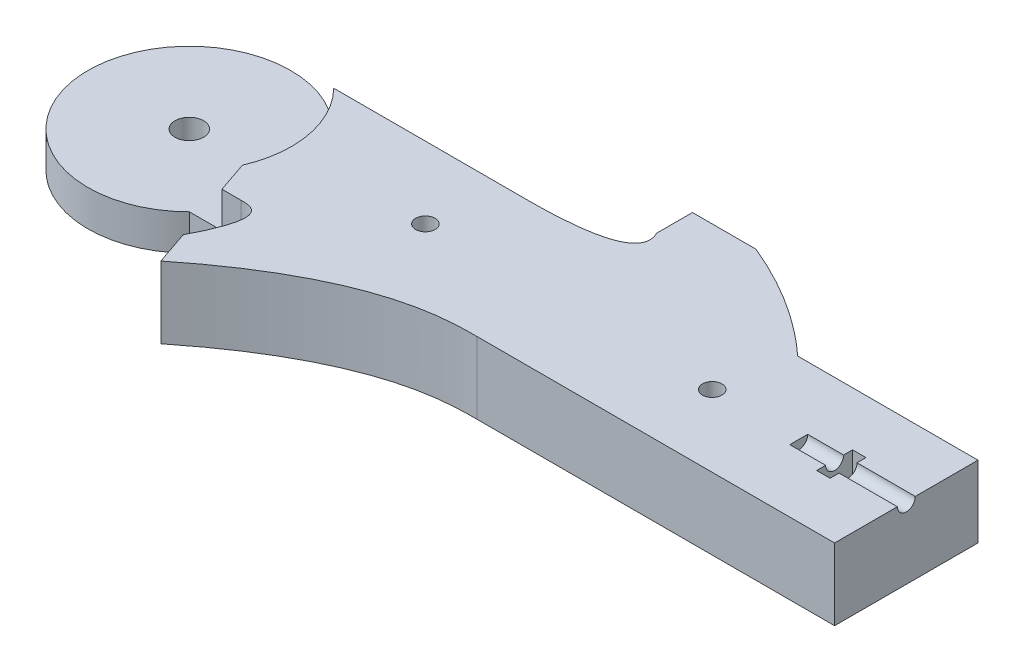
ISO-10303-21;
HEADER;
FILE_DESCRIPTION(('STEP AP214'),'2;1');
FILE_NAME('part.step','',(''),(''),'','','');
FILE_SCHEMA(('AUTOMOTIVE_DESIGN { 1 0 10303 214 1 1 1 1 }'));
ENDSEC;
DATA;
#1=APPLICATION_CONTEXT('core data for automotive mechanical design processes');
#2=APPLICATION_PROTOCOL_DEFINITION('international standard','automotive_design',2000,#1);
#3=PRODUCT_CONTEXT('',#1,'mechanical');
#4=PRODUCT('Part','Part','',(#3));
#5=PRODUCT_RELATED_PRODUCT_CATEGORY('part','',(#4));
#6=PRODUCT_DEFINITION_FORMATION('','',#4);
#7=PRODUCT_DEFINITION_CONTEXT('part definition',#1,'design');
#8=PRODUCT_DEFINITION('design','',#6,#7);
#9=PRODUCT_DEFINITION_SHAPE('','',#8);
#10=(LENGTH_UNIT() NAMED_UNIT(*) SI_UNIT(.MILLI.,.METRE.));
#11=(NAMED_UNIT(*) PLANE_ANGLE_UNIT() SI_UNIT($,.RADIAN.));
#12=(NAMED_UNIT(*) SI_UNIT($,.STERADIAN.) SOLID_ANGLE_UNIT());
#13=UNCERTAINTY_MEASURE_WITH_UNIT(LENGTH_MEASURE(1.E-05),#10,'distance_accuracy_value','');
#14=(GEOMETRIC_REPRESENTATION_CONTEXT(3) GLOBAL_UNCERTAINTY_ASSIGNED_CONTEXT((#13)) GLOBAL_UNIT_ASSIGNED_CONTEXT((#10,
#11,#12)) REPRESENTATION_CONTEXT('',''));
#15=CARTESIAN_POINT('',(0.,0.,0.));
#16=DIRECTION('',(0.,0.,1.));
#17=DIRECTION('',(1.,0.,0.));
#18=AXIS2_PLACEMENT_3D('',#15,#16,#17);
#19=CARTESIAN_POINT('',(-56.5620370370371,12.7,-6.10151852993586));
#20=DIRECTION('',(0.,0.,1.));
#21=DIRECTION('',(1.,0.,0.));
#22=AXIS2_PLACEMENT_3D('',#19,#20,#21);
#23=PLANE('',#22);
#24=DIRECTION('',(0.,1.,0.));
#25=VECTOR('',#24,1.);
#26=CARTESIAN_POINT('',(-22.0521428441884,-49.5130237421217,-6.10151852993586));
#27=LINE('',#26,#25);
#28=CARTESIAN_POINT('',(-22.0521428441884,0.,-6.10151852993586));
#29=VERTEX_POINT('',#28);
#30=CARTESIAN_POINT('',(-22.0521428441884,12.7,-6.10151852993586));
#31=VERTEX_POINT('',#30);
#32=EDGE_CURVE('E50',#29,#31,#27,.T.);
#33=ORIENTED_EDGE('',*,*,#32,.F.);
#34=DIRECTION('',(-1.,0.,0.));
#35=VECTOR('',#34,1.);
#36=CARTESIAN_POINT('',(-56.5620370370371,0.,-6.10151852993586));
#37=LINE('',#36,#35);
#38=CARTESIAN_POINT('',(-56.5620370370371,0.,-6.10151852993586));
#39=VERTEX_POINT('',#38);
#40=EDGE_CURVE('E414',#29,#39,#37,.T.);
#41=ORIENTED_EDGE('',*,*,#40,.T.);
#42=DIRECTION('',(0.,-1.,0.));
#43=VECTOR('',#42,1.);
#44=CARTESIAN_POINT('',(-56.5620370370371,12.7,-6.10151852993586));
#45=LINE('',#44,#43);
#46=CARTESIAN_POINT('',(-56.5620370370371,6.35,-6.10151852993585));
#47=VERTEX_POINT('',#46);
#48=EDGE_CURVE('E428',#47,#39,#45,.T.);
#49=ORIENTED_EDGE('',*,*,#48,.F.);
#50=DIRECTION('',(-1.,0.,0.));
#51=VECTOR('',#50,1.);
#52=CARTESIAN_POINT('',(-56.5620370370371,6.35,-6.10151852993586));
#53=LINE('',#52,#51);
#54=CARTESIAN_POINT('',(-56.3690348168402,6.35,-6.10151852993586));
#55=VERTEX_POINT('',#54);
#56=EDGE_CURVE('E392',#55,#47,#53,.T.);
#57=ORIENTED_EDGE('',*,*,#56,.F.);
#58=DIRECTION('',(0.,1.,0.));
#59=VECTOR('',#58,1.);
#60=CARTESIAN_POINT('',(-56.3690348168402,6.35,-6.10151852993586));
#61=LINE('',#60,#59);
#62=CARTESIAN_POINT('',(-56.3690348168402,12.7,-6.10151852993586));
#63=VERTEX_POINT('',#62);
#64=EDGE_CURVE('E394',#55,#63,#61,.T.);
#65=ORIENTED_EDGE('',*,*,#64,.T.);
#66=DIRECTION('',(-1.,0.,0.));
#67=VECTOR('',#66,1.);
#68=CARTESIAN_POINT('',(-56.5620370370371,12.7,-6.10151852993586));
#69=LINE('',#68,#67);
#70=EDGE_CURVE('E55',#31,#63,#69,.T.);
#71=ORIENTED_EDGE('',*,*,#70,.F.);
#72=EDGE_LOOP('',(#33,#41,#49,#57,#65,#71));
#73=FACE_BOUND('',#72,.T.);
#74=ADVANCED_FACE('F35',(#73),#23,.F.);
#75=DIRECTION('',(0.,1.,0.));
#76=VECTOR('',#75,1.);
#77=CARTESIAN_POINT('',(25.8044086413491,-49.5130237421217,-6.10151852993586));
#78=LINE('',#77,#76);
#79=CARTESIAN_POINT('',(25.8044086413491,0.,-6.10151852993586));
#80=VERTEX_POINT('',#79);
#81=CARTESIAN_POINT('',(25.8044086413491,12.7,-6.10151852993586));
#82=VERTEX_POINT('',#81);
#83=EDGE_CURVE('E255',#80,#82,#78,.T.);
#84=ORIENTED_EDGE('',*,*,#83,.T.);
#85=CARTESIAN_POINT('',(57.7379629629629,12.7,-6.10151852993586));
#86=VERTEX_POINT('',#85);
#87=EDGE_CURVE('E404',#86,#82,#69,.T.);
#88=ORIENTED_EDGE('',*,*,#87,.F.);
#89=DIRECTION('',(0.,-1.,0.));
#90=VECTOR('',#89,1.);
#91=CARTESIAN_POINT('',(57.7379629629629,12.7,-6.10151852993586));
#92=LINE('',#91,#90);
#93=CARTESIAN_POINT('',(57.7379629629629,0.,-6.10151852993586));
#94=VERTEX_POINT('',#93);
#95=EDGE_CURVE('E431',#86,#94,#92,.T.);
#96=ORIENTED_EDGE('',*,*,#95,.T.);
#97=EDGE_CURVE('E415',#94,#80,#37,.T.);
#98=ORIENTED_EDGE('',*,*,#97,.T.);
#99=EDGE_LOOP('',(#84,#88,#96,#98));
#100=FACE_BOUND('',#99,.T.);
#101=ADVANCED_FACE('F460',(#100),#23,.F.);
#102=CARTESIAN_POINT('',(-56.5620370370371,12.7,19.2984814700641));
#103=DIRECTION('',(0.,0.,-1.));
#104=DIRECTION('',(-1.,0.,0.));
#105=AXIS2_PLACEMENT_3D('',#102,#103,#104);
#106=PLANE('',#105);
#107=DIRECTION('',(0.,1.,0.));
#108=VECTOR('',#107,1.);
#109=CARTESIAN_POINT('',(-5.57588640904783,-44.9106074814327,19.2984814700641));
#110=LINE('',#109,#108);
#111=CARTESIAN_POINT('',(-5.57588640904783,0.,19.2984814700641));
#112=VERTEX_POINT('',#111);
#113=CARTESIAN_POINT('',(-5.57588640904783,12.7,19.2984814700641));
#114=VERTEX_POINT('',#113);
#115=EDGE_CURVE('E824',#112,#114,#110,.T.);
#116=ORIENTED_EDGE('',*,*,#115,.F.);
#117=DIRECTION('',(1.,0.,0.));
#118=VECTOR('',#117,1.);
#119=CARTESIAN_POINT('',(-56.5620370370371,0.,19.2984814700641));
#120=LINE('',#119,#118);
#121=CARTESIAN_POINT('',(57.7379629629629,0.,19.2984814700641));
#122=VERTEX_POINT('',#121);
#123=EDGE_CURVE('E420',#112,#122,#120,.T.);
#124=ORIENTED_EDGE('',*,*,#123,.T.);
#125=DIRECTION('',(0.,-1.,0.));
#126=VECTOR('',#125,1.);
#127=CARTESIAN_POINT('',(57.7379629629629,12.7,19.2984814700641));
#128=LINE('',#127,#126);
#129=CARTESIAN_POINT('',(57.7379629629629,12.7,19.2984814700641));
#130=VERTEX_POINT('',#129);
#131=EDGE_CURVE('E411',#130,#122,#128,.T.);
#132=ORIENTED_EDGE('',*,*,#131,.F.);
#133=DIRECTION('',(1.,0.,0.));
#134=VECTOR('',#133,1.);
#135=CARTESIAN_POINT('',(-56.5620370370371,12.7,19.2984814700641));
#136=LINE('',#135,#134);
#137=EDGE_CURVE('E407',#114,#130,#136,.T.);
#138=ORIENTED_EDGE('',*,*,#137,.F.);
#139=EDGE_LOOP('',(#116,#124,#132,#138));
#140=FACE_BOUND('',#139,.T.);
#141=ADVANCED_FACE('F505',(#140),#106,.F.);
#142=CARTESIAN_POINT('',(38.6879629629629,12.7,6.59848147006414));
#143=DIRECTION('',(1.,0.,0.));
#144=DIRECTION('',(0.,0.,-1.));
#145=AXIS2_PLACEMENT_3D('',#142,#143,#144);
#146=CYLINDRICAL_SURFACE('',#145,1.5875);
#147=DIRECTION('',(1.,0.,0.));
#148=VECTOR('',#147,1.);
#149=CARTESIAN_POINT('',(38.6879629629629,12.7,8.18598147006414));
#150=LINE('',#149,#148);
#151=CARTESIAN_POINT('',(45.0379629629629,12.7,8.18598147006414));
#152=VERTEX_POINT('',#151);
#153=CARTESIAN_POINT('',(38.6879629629629,12.7,8.18598147006414));
#154=VERTEX_POINT('',#153);
#155=EDGE_CURVE('E351',#152,#154,#150,.F.);
#156=ORIENTED_EDGE('',*,*,#155,.F.);
#157=CARTESIAN_POINT('',(45.0379629629629,12.7,6.59848147006414));
#158=DIRECTION('',(-1.,0.,0.));
#159=DIRECTION('',(0.,0.,1.));
#160=AXIS2_PLACEMENT_3D('',#157,#158,#159);
#161=CIRCLE('',#160,1.5875);
#162=CARTESIAN_POINT('',(45.0379629629629,12.7,5.01098147006415));
#163=VERTEX_POINT('',#162);
#164=EDGE_CURVE('E11',#152,#163,#161,.F.);
#165=ORIENTED_EDGE('',*,*,#164,.T.);
#166=DIRECTION('',(1.,0.,0.));
#167=VECTOR('',#166,1.);
#168=CARTESIAN_POINT('',(38.6879629629629,12.7,5.01098147006414));
#169=LINE('',#168,#167);
#170=CARTESIAN_POINT('',(38.6879629629629,12.7,5.01098147006414));
#171=VERTEX_POINT('',#170);
#172=EDGE_CURVE('E356',#171,#163,#169,.T.);
#173=ORIENTED_EDGE('',*,*,#172,.F.);
#174=CARTESIAN_POINT('',(38.6879629629629,12.7,6.59848147006414));
#175=DIRECTION('',(1.,0.,0.));
#176=DIRECTION('',(0.,0.,-1.));
#177=AXIS2_PLACEMENT_3D('',#174,#175,#176);
#178=CIRCLE('',#177,1.5875);
#179=EDGE_CURVE('E348',#154,#171,#178,.T.);
#180=ORIENTED_EDGE('',*,*,#179,.F.);
#181=EDGE_LOOP('',(#156,#165,#173,#180));
#182=FACE_BOUND('',#181,.T.);
#183=ADVANCED_FACE('F514',(#182),#146,.F.);
#184=CARTESIAN_POINT('',(-69.262037037037,12.7,6.59848147006414));
#185=DIRECTION('',(0.,-1.,0.));
#186=DIRECTION('',(0.,0.,-1.));
#187=AXIS2_PLACEMENT_3D('',#184,#185,#186);
#188=CYLINDRICAL_SURFACE('',#187,17.9605122421383);
#189=CARTESIAN_POINT('',(-69.262037037037,6.35,6.59848147006414));
#190=DIRECTION('',(0.,1.,0.));
#191=DIRECTION('',(0.,0.,1.));
#192=AXIS2_PLACEMENT_3D('',#189,#190,#191);
#193=CIRCLE('',#192,17.9605122421383);
#194=CARTESIAN_POINT('',(-56.5620370370371,6.35,19.2984814700641));
#195=VERTEX_POINT('',#194);
#196=EDGE_CURVE('E390',#47,#195,#193,.T.);
#197=ORIENTED_EDGE('',*,*,#196,.F.);
#198=ORIENTED_EDGE('',*,*,#48,.T.);
#199=CARTESIAN_POINT('',(-69.262037037037,0.,6.59848147006414));
#200=DIRECTION('',(0.,1.,0.));
#201=DIRECTION('',(0.,0.,-1.));
#202=AXIS2_PLACEMENT_3D('',#199,#200,#201);
#203=CIRCLE('',#202,17.9605122421383);
#204=CARTESIAN_POINT('',(-56.5620370370371,0.,19.2984814700641));
#205=VERTEX_POINT('',#204);
#206=EDGE_CURVE('E417',#39,#205,#203,.T.);
#207=ORIENTED_EDGE('',*,*,#206,.T.);
#208=DIRECTION('',(0.,-1.,0.));
#209=VECTOR('',#208,1.);
#210=CARTESIAN_POINT('',(-56.5620370370371,12.7,19.2984814700641));
#211=LINE('',#210,#209);
#212=EDGE_CURVE('E426',#195,#205,#211,.T.);
#213=ORIENTED_EDGE('',*,*,#212,.F.);
#214=EDGE_LOOP('',(#197,#198,#207,#213));
#215=FACE_BOUND('',#214,.T.);
#216=ADVANCED_FACE('F475',(#215),#188,.T.);
#217=CARTESIAN_POINT('',(-69.262037037037,12.7,6.59848147006414));
#218=DIRECTION('',(0.,-1.,0.));
#219=DIRECTION('',(0.,0.,-1.));
#220=AXIS2_PLACEMENT_3D('',#217,#218,#219);
#221=CYLINDRICAL_SURFACE('',#220,2.54);
#222=CARTESIAN_POINT('',(-69.262037037037,0.,6.59848147006414));
#223=DIRECTION('',(0.,1.,0.));
#224=DIRECTION('',(0.,0.,1.));
#225=AXIS2_PLACEMENT_3D('',#222,#223,#224);
#226=CIRCLE('',#225,2.54);
#227=CARTESIAN_POINT('',(-69.262037037037,0.,9.13848147006414));
#228=VERTEX_POINT('',#227);
#229=EDGE_CURVE('E396',#228,#228,#226,.T.);
#230=ORIENTED_EDGE('',*,*,#229,.F.);
#231=EDGE_LOOP('',(#230));
#232=FACE_BOUND('',#231,.T.);
#233=CARTESIAN_POINT('',(-69.262037037037,6.35,6.59848147006414));
#234=DIRECTION('',(0.,1.,0.));
#235=DIRECTION('',(0.,0.,1.));
#236=AXIS2_PLACEMENT_3D('',#233,#234,#235);
#237=CIRCLE('',#236,2.54);
#238=CARTESIAN_POINT('',(-69.262037037037,6.35,9.13848147006414));
#239=VERTEX_POINT('',#238);
#240=EDGE_CURVE('E385',#239,#239,#237,.T.);
#241=ORIENTED_EDGE('',*,*,#240,.T.);
#242=EDGE_LOOP('',(#241));
#243=FACE_BOUND('',#242,.T.);
#244=ADVANCED_FACE('F513',(#232,#243),#221,.F.);
#245=CARTESIAN_POINT('',(-69.262037037037,12.7,6.59848147006414));
#246=DIRECTION('',(0.,-1.,0.));
#247=DIRECTION('',(0.,0.,-1.));
#248=AXIS2_PLACEMENT_3D('',#245,#246,#247);
#249=PLANE('',#248);
#250=CARTESIAN_POINT('',(-27.4422931581062,12.7,6.59848147006414));
#251=DIRECTION('',(0.,-1.,0.));
#252=DIRECTION('',(0.,0.,-1.));
#253=AXIS2_PLACEMENT_3D('',#250,#251,#252);
#254=CIRCLE('',#253,1.72720000000001);
#255=CARTESIAN_POINT('',(-27.4422931581062,12.7,4.87128147006413));
#256=VERTEX_POINT('',#255);
#257=EDGE_CURVE('E367',#256,#256,#254,.T.);
#258=ORIENTED_EDGE('',*,*,#257,.T.);
#259=EDGE_LOOP('',(#258));
#260=FACE_BOUND('',#259,.T.);
#261=CARTESIAN_POINT('',(23.3577068418938,12.7,6.59848147006414));
#262=DIRECTION('',(0.,-1.,0.));
#263=DIRECTION('',(0.,0.,-1.));
#264=AXIS2_PLACEMENT_3D('',#261,#262,#263);
#265=CIRCLE('',#264,1.72720000000001);
#266=CARTESIAN_POINT('',(23.3577068418938,12.7,4.87128147006413));
#267=VERTEX_POINT('',#266);
#268=EDGE_CURVE('E379',#267,#267,#265,.T.);
#269=ORIENTED_EDGE('',*,*,#268,.T.);
#270=EDGE_LOOP('',(#269));
#271=FACE_BOUND('',#270,.T.);
#272=ORIENTED_EDGE('',*,*,#172,.T.);
#273=DIRECTION('',(0.,0.,1.));
#274=VECTOR('',#273,1.);
#275=CARTESIAN_POINT('',(45.0379629629629,12.7,9.77348147006416));
#276=LINE('',#275,#274);
#277=CARTESIAN_POINT('',(45.0379629629629,12.7,3.42348147006413));
#278=VERTEX_POINT('',#277);
#279=EDGE_CURVE('E326',#278,#163,#276,.T.);
#280=ORIENTED_EDGE('',*,*,#279,.F.);
#281=DIRECTION('',(-1.,0.,0.));
#282=VECTOR('',#281,1.);
#283=CARTESIAN_POINT('',(45.0379629629629,12.7,3.42348147006413));
#284=LINE('',#283,#282);
#285=CARTESIAN_POINT('',(47.4192129629629,12.7,3.42348147006413));
#286=VERTEX_POINT('',#285);
#287=EDGE_CURVE('E322',#286,#278,#284,.T.);
#288=ORIENTED_EDGE('',*,*,#287,.F.);
#289=DIRECTION('',(0.,0.,-1.));
#290=VECTOR('',#289,1.);
#291=CARTESIAN_POINT('',(47.4192129629629,12.7,3.42348147006413));
#292=LINE('',#291,#290);
#293=CARTESIAN_POINT('',(47.4192129629629,12.7,5.01098147006414));
#294=VERTEX_POINT('',#293);
#295=EDGE_CURVE('E318',#294,#286,#292,.T.);
#296=ORIENTED_EDGE('',*,*,#295,.F.);
#297=CARTESIAN_POINT('',(57.7379629629629,12.7,5.01098147006414));
#298=VERTEX_POINT('',#297);
#299=EDGE_CURVE('E355',#294,#298,#169,.T.);
#300=ORIENTED_EDGE('',*,*,#299,.T.);
#301=DIRECTION('',(0.,0.,-1.));
#302=VECTOR('',#301,1.);
#303=CARTESIAN_POINT('',(57.7379629629629,12.7,-6.10151852993586));
#304=LINE('',#303,#302);
#305=EDGE_CURVE('E403',#298,#86,#304,.T.);
#306=ORIENTED_EDGE('',*,*,#305,.T.);
#307=ORIENTED_EDGE('',*,*,#87,.T.);
#308=CARTESIAN_POINT('',(5.68711721311388,12.7,-18.8015185299359));
#309=CARTESIAN_POINT('',(17.0941996057411,12.7,-14.1176448631186));
#310=CARTESIAN_POINT('',(25.8044086413491,12.7,-6.10151852993586));
#311=B_SPLINE_CURVE_WITH_KNOTS('',2,(#308,#309,#310),.UNSPECIFIED.,.F.,.F.,(3,3),(0.,
0.7699329234087),.UNSPECIFIED.);
#312=CARTESIAN_POINT('',(5.68711721311388,12.7,-18.8015185299359));
#313=VERTEX_POINT('',#312);
#314=EDGE_CURVE('E227',#313,#82,#311,.T.);
#315=ORIENTED_EDGE('',*,*,#314,.F.);
#316=DIRECTION('',(1.,0.,0.));
#317=VECTOR('',#316,1.);
#318=CARTESIAN_POINT('',(-5.54086763995443,12.7,-18.8015185299359));
#319=LINE('',#318,#317);
#320=CARTESIAN_POINT('',(-5.54086763995443,12.7,-18.8015185299359));
#321=VERTEX_POINT('',#320);
#322=EDGE_CURVE('E204',#321,#313,#319,.T.);
#323=ORIENTED_EDGE('',*,*,#322,.F.);
#324=DIRECTION('',(0.,0.,-1.));
#325=VECTOR('',#324,1.);
#326=CARTESIAN_POINT('',(-5.54086763995443,12.7,-12.4515185299359));
#327=LINE('',#326,#325);
#328=CARTESIAN_POINT('',(-5.54086763995443,12.7,-12.4515185299359));
#329=VERTEX_POINT('',#328);
#330=EDGE_CURVE('E199',#329,#321,#327,.T.);
#331=ORIENTED_EDGE('',*,*,#330,.F.);
#332=CARTESIAN_POINT('',(-5.54086763995443,12.7,-12.4515185299359));
#333=CARTESIAN_POINT('',(-2.45676013605589,12.7,-6.10151852993586));
#334=CARTESIAN_POINT('',(-22.0521428441884,12.7,-6.10151852993586));
#335=B_SPLINE_CURVE_WITH_KNOTS('',2,(#332,#333,#334),.UNSPECIFIED.,.F.,.F.,(3,3),(0.,1.),.UNSPECIFIED.);
#336=EDGE_CURVE('E211',#329,#31,#335,.T.);
#337=ORIENTED_EDGE('',*,*,#336,.T.);
#338=ORIENTED_EDGE('',*,*,#70,.T.);
#339=CARTESIAN_POINT('',(-69.262037037037,12.7,6.59848147006414));
#340=DIRECTION('',(0.,1.,0.));
#341=DIRECTION('',(0.,0.,1.));
#342=AXIS2_PLACEMENT_3D('',#339,#340,#341);
#343=CIRCLE('',#342,18.0975);
#344=CARTESIAN_POINT('',(-52.6576296854306,12.7,13.796617531012));
#345=VERTEX_POINT('',#344);
#346=EDGE_CURVE('E382',#345,#63,#343,.T.);
#347=ORIENTED_EDGE('',*,*,#346,.F.);
#348=DIRECTION('',(-0.322805874294675,0.,-0.946465196148728));
#349=VECTOR('',#348,1.);
#350=CARTESIAN_POINT('',(-50.7811380761005,12.7,19.2984814700641));
#351=LINE('',#350,#349);
#352=CARTESIAN_POINT('',(-50.7811380761005,12.7,19.2984814700641));
#353=VERTEX_POINT('',#352);
#354=EDGE_CURVE('E338',#353,#345,#351,.T.);
#355=ORIENTED_EDGE('',*,*,#354,.F.);
#356=CARTESIAN_POINT('',(-47.3781705248904,12.7,19.2984814700641));
#357=VERTEX_POINT('',#356);
#358=EDGE_CURVE('E408',#353,#357,#136,.T.);
#359=ORIENTED_EDGE('',*,*,#358,.T.);
#360=CARTESIAN_POINT('',(-47.2315525581981,12.7,29.7058483148863));
#361=CARTESIAN_POINT('',(-41.7251153372007,12.7,19.2984814700641));
#362=CARTESIAN_POINT('',(-45.408751787825,12.7,19.2984814700641));
#363=CARTESIAN_POINT('',(-47.3781705248904,12.7,19.2984814700641));
#364=B_SPLINE_CURVE_WITH_KNOTS('',3,(#360,#361,#362,#363),.UNSPECIFIED.,.F.,.F.,(4,4),(0.,1.),.UNSPECIFIED.);
#365=CARTESIAN_POINT('',(-47.2315525581981,12.7,29.7058483148863));
#366=VERTEX_POINT('',#365);
#367=EDGE_CURVE('E840',#366,#357,#364,.T.);
#368=ORIENTED_EDGE('',*,*,#367,.F.);
#369=DIRECTION('',(-0.322805874294675,0.,-0.946465196148728));
#370=VECTOR('',#369,1.);
#371=CARTESIAN_POINT('',(-45.1817352564269,12.7,35.7159023104307));
#372=LINE('',#371,#370);
#373=CARTESIAN_POINT('',(-45.1817352564269,12.7,35.7159023104307));
#374=VERTEX_POINT('',#373);
#375=EDGE_CURVE('E319',#374,#366,#372,.T.);
#376=ORIENTED_EDGE('',*,*,#375,.F.);
#377=CARTESIAN_POINT('',(-45.1817352564269,12.7,35.7159023104307));
#378=CARTESIAN_POINT('',(-24.6245664486509,12.7,19.2984814700641));
#379=CARTESIAN_POINT('',(-11.56568916727,12.7,19.2984814700641));
#380=CARTESIAN_POINT('',(-5.57588640904783,12.7,19.2984814700641));
#381=B_SPLINE_CURVE_WITH_KNOTS('',3,(#377,#378,#379,#380),.UNSPECIFIED.,.F.,.F.,(4,4),(0.,1.),.UNSPECIFIED.);
#382=EDGE_CURVE('E832',#374,#114,#381,.T.);
#383=ORIENTED_EDGE('',*,*,#382,.T.);
#384=ORIENTED_EDGE('',*,*,#137,.T.);
#385=CARTESIAN_POINT('',(57.7379629629629,12.7,8.18598147006414));
#386=VERTEX_POINT('',#385);
#387=EDGE_CURVE('E400',#130,#386,#304,.T.);
#388=ORIENTED_EDGE('',*,*,#387,.T.);
#389=CARTESIAN_POINT('',(47.4192129629629,12.7,8.18598147006414));
#390=VERTEX_POINT('',#389);
#391=EDGE_CURVE('E352',#386,#390,#150,.F.);
#392=ORIENTED_EDGE('',*,*,#391,.T.);
#393=CARTESIAN_POINT('',(47.4192129629629,12.7,9.77348147006416));
#394=VERTEX_POINT('',#393);
#395=EDGE_CURVE('E320',#394,#390,#292,.T.);
#396=ORIENTED_EDGE('',*,*,#395,.F.);
#397=DIRECTION('',(1.,0.,0.));
#398=VECTOR('',#397,1.);
#399=CARTESIAN_POINT('',(45.0379629629629,12.7,9.77348147006416));
#400=LINE('',#399,#398);
#401=CARTESIAN_POINT('',(45.0379629629629,12.7,9.77348147006416));
#402=VERTEX_POINT('',#401);
#403=EDGE_CURVE('E315',#402,#394,#400,.T.);
#404=ORIENTED_EDGE('',*,*,#403,.F.);
#405=EDGE_CURVE('E325',#152,#402,#276,.T.);
#406=ORIENTED_EDGE('',*,*,#405,.F.);
#407=ORIENTED_EDGE('',*,*,#155,.T.);
#408=DIRECTION('',(0.,0.,1.));
#409=VECTOR('',#408,1.);
#410=CARTESIAN_POINT('',(38.6879629629629,12.7,6.59848147006414));
#411=LINE('',#410,#409);
#412=EDGE_CURVE('E439',#171,#154,#411,.T.);
#413=ORIENTED_EDGE('',*,*,#412,.F.);
#414=EDGE_LOOP('',(#272,#280,#288,#296,#300,#306,#307,#315,#323,#331,#337,#338,#347,#355,#359,
#368,#376,#383,#384,#388,#392,#396,#404,#406,#407,#413));
#415=FACE_BOUND('',#414,.T.);
#416=ADVANCED_FACE('F210',(#260,#271,#415),#249,.F.);
#417=CARTESIAN_POINT('',(-69.262037037037,0.,6.59848147006414));
#418=DIRECTION('',(0.,-1.,0.));
#419=DIRECTION('',(0.,0.,-1.));
#420=AXIS2_PLACEMENT_3D('',#417,#418,#419);
#421=PLANE('',#420);
#422=CARTESIAN_POINT('',(-27.4422931581062,0.,6.59848147006414));
#423=DIRECTION('',(0.,-1.,0.));
#424=DIRECTION('',(0.,0.,-1.));
#425=AXIS2_PLACEMENT_3D('',#422,#423,#424);
#426=CIRCLE('',#425,3.77062999999999);
#427=CARTESIAN_POINT('',(-27.4422931581062,0.,2.82785147006415));
#428=VERTEX_POINT('',#427);
#429=EDGE_CURVE('E358',#428,#428,#426,.T.);
#430=ORIENTED_EDGE('',*,*,#429,.F.);
#431=EDGE_LOOP('',(#430));
#432=FACE_BOUND('',#431,.T.);
#433=CARTESIAN_POINT('',(23.3577068418938,0.,6.59848147006414));
#434=DIRECTION('',(0.,-1.,0.));
#435=DIRECTION('',(0.,0.,-1.));
#436=AXIS2_PLACEMENT_3D('',#433,#434,#435);
#437=CIRCLE('',#436,3.77062999999999);
#438=CARTESIAN_POINT('',(23.3577068418938,0.,2.82785147006415));
#439=VERTEX_POINT('',#438);
#440=EDGE_CURVE('E370',#439,#439,#437,.T.);
#441=ORIENTED_EDGE('',*,*,#440,.F.);
#442=EDGE_LOOP('',(#441));
#443=FACE_BOUND('',#442,.T.);
#444=DIRECTION('',(0.,0.,-1.));
#445=VECTOR('',#444,1.);
#446=CARTESIAN_POINT('',(57.7379629629629,0.,-6.10151852993586));
#447=LINE('',#446,#445);
#448=EDGE_CURVE('E399',#122,#94,#447,.T.);
#449=ORIENTED_EDGE('',*,*,#448,.F.);
#450=ORIENTED_EDGE('',*,*,#123,.F.);
#451=CARTESIAN_POINT('',(-45.1817352564269,0.,35.7159023104307));
#452=CARTESIAN_POINT('',(-24.6245664486509,0.,19.2984814700641));
#453=CARTESIAN_POINT('',(-11.56568916727,0.,19.2984814700641));
#454=CARTESIAN_POINT('',(-5.57588640904783,0.,19.2984814700641));
#455=B_SPLINE_CURVE_WITH_KNOTS('',3,(#451,#452,#453,#454),.UNSPECIFIED.,.F.,.F.,(4,4),(0.,1.),.UNSPECIFIED.);
#456=CARTESIAN_POINT('',(-45.1817352564269,0.,35.7159023104307));
#457=VERTEX_POINT('',#456);
#458=EDGE_CURVE('E828',#457,#112,#455,.T.);
#459=ORIENTED_EDGE('',*,*,#458,.F.);
#460=DIRECTION('',(-0.322805874294675,0.,-0.946465196148728));
#461=VECTOR('',#460,1.);
#462=CARTESIAN_POINT('',(-45.1817352564269,0.,35.7159023104307));
#463=LINE('',#462,#461);
#464=CARTESIAN_POINT('',(-47.2315525581981,0.,29.7058483148863));
#465=VERTEX_POINT('',#464);
#466=EDGE_CURVE('E214',#457,#465,#463,.T.);
#467=ORIENTED_EDGE('',*,*,#466,.T.);
#468=CARTESIAN_POINT('',(-47.2315525581981,0.,29.7058483148863));
#469=CARTESIAN_POINT('',(-41.7251153372007,0.,19.2984814700641));
#470=CARTESIAN_POINT('',(-45.408751787825,0.,19.2984814700641));
#471=CARTESIAN_POINT('',(-47.3781705248904,0.,19.2984814700641));
#472=B_SPLINE_CURVE_WITH_KNOTS('',3,(#468,#469,#470,#471),.UNSPECIFIED.,.F.,.F.,(4,4),(0.,1.),.UNSPECIFIED.);
#473=CARTESIAN_POINT('',(-47.3781705248904,0.,19.2984814700641));
#474=VERTEX_POINT('',#473);
#475=EDGE_CURVE('E838',#465,#474,#472,.T.);
#476=ORIENTED_EDGE('',*,*,#475,.T.);
#477=EDGE_CURVE('E421',#205,#474,#120,.T.);
#478=ORIENTED_EDGE('',*,*,#477,.F.);
#479=ORIENTED_EDGE('',*,*,#206,.F.);
#480=ORIENTED_EDGE('',*,*,#40,.F.);
#481=CARTESIAN_POINT('',(-5.54086763995443,0.,-12.4515185299359));
#482=CARTESIAN_POINT('',(-2.45676013605589,0.,-6.10151852993586));
#483=CARTESIAN_POINT('',(-22.0521428441884,0.,-6.10151852993586));
#484=B_SPLINE_CURVE_WITH_KNOTS('',2,(#481,#482,#483),.UNSPECIFIED.,.F.,.F.,(3,3),(0.,1.),.UNSPECIFIED.);
#485=CARTESIAN_POINT('',(-5.54086763995443,0.,-12.4515185299359));
#486=VERTEX_POINT('',#485);
#487=EDGE_CURVE('E217',#486,#29,#484,.T.);
#488=ORIENTED_EDGE('',*,*,#487,.F.);
#489=DIRECTION('',(0.,0.,-1.));
#490=VECTOR('',#489,1.);
#491=CARTESIAN_POINT('',(-5.54086763995443,0.,-12.4515185299359));
#492=LINE('',#491,#490);
#493=CARTESIAN_POINT('',(-5.54086763995443,0.,-18.8015185299359));
#494=VERTEX_POINT('',#493);
#495=EDGE_CURVE('E200',#486,#494,#492,.T.);
#496=ORIENTED_EDGE('',*,*,#495,.T.);
#497=DIRECTION('',(1.,0.,0.));
#498=VECTOR('',#497,1.);
#499=CARTESIAN_POINT('',(-5.54086763995443,0.,-18.8015185299359));
#500=LINE('',#499,#498);
#501=CARTESIAN_POINT('',(5.68711721311388,0.,-18.8015185299359));
#502=VERTEX_POINT('',#501);
#503=EDGE_CURVE('E222',#494,#502,#500,.T.);
#504=ORIENTED_EDGE('',*,*,#503,.T.);
#505=CARTESIAN_POINT('',(5.68711721311388,0.,-18.8015185299359));
#506=CARTESIAN_POINT('',(17.0941996057411,0.,-14.1176448631186));
#507=CARTESIAN_POINT('',(25.8044086413491,0.,-6.10151852993586));
#508=B_SPLINE_CURVE_WITH_KNOTS('',2,(#505,#506,#507),.UNSPECIFIED.,.F.,.F.,(3,3),(0.,
0.7699329234087),.UNSPECIFIED.);
#509=EDGE_CURVE('E218',#502,#80,#508,.T.);
#510=ORIENTED_EDGE('',*,*,#509,.T.);
#511=ORIENTED_EDGE('',*,*,#97,.F.);
#512=EDGE_LOOP('',(#449,#450,#459,#467,#476,#478,#479,#480,#488,#496,#504,#510,#511));
#513=FACE_BOUND('',#512,.T.);
#514=ORIENTED_EDGE('',*,*,#229,.T.);
#515=EDGE_LOOP('',(#514));
#516=FACE_BOUND('',#515,.T.);
#517=ADVANCED_FACE('F467',(#432,#443,#513,#516),#421,.T.);
#518=CARTESIAN_POINT('',(57.7379629629629,12.7,-6.10151852993586));
#519=DIRECTION('',(-1.,0.,0.));
#520=DIRECTION('',(0.,0.,1.));
#521=AXIS2_PLACEMENT_3D('',#518,#519,#520);
#522=PLANE('',#521);
#523=ORIENTED_EDGE('',*,*,#305,.F.);
#524=CARTESIAN_POINT('',(57.7379629629629,12.7,6.59848147006414));
#525=DIRECTION('',(-1.,0.,0.));
#526=DIRECTION('',(0.,0.,1.));
#527=AXIS2_PLACEMENT_3D('',#524,#525,#526);
#528=CIRCLE('',#527,1.5875);
#529=EDGE_CURVE('E434',#298,#386,#528,.T.);
#530=ORIENTED_EDGE('',*,*,#529,.T.);
#531=ORIENTED_EDGE('',*,*,#387,.F.);
#532=ORIENTED_EDGE('',*,*,#131,.T.);
#533=ORIENTED_EDGE('',*,*,#448,.T.);
#534=ORIENTED_EDGE('',*,*,#95,.F.);
#535=EDGE_LOOP('',(#523,#530,#531,#532,#533,#534));
#536=FACE_BOUND('',#535,.T.);
#537=ADVANCED_FACE('F37',(#536),#522,.F.);
#538=ORIENTED_EDGE('',*,*,#477,.T.);
#539=DIRECTION('',(0.,1.,0.));
#540=VECTOR('',#539,1.);
#541=CARTESIAN_POINT('',(-47.3781705248904,-44.9106074814327,19.2984814700641));
#542=LINE('',#541,#540);
#543=EDGE_CURVE('E827',#474,#357,#542,.T.);
#544=ORIENTED_EDGE('',*,*,#543,.T.);
#545=ORIENTED_EDGE('',*,*,#358,.F.);
#546=DIRECTION('',(0.,1.,0.));
#547=VECTOR('',#546,1.);
#548=CARTESIAN_POINT('',(-50.7811380761005,-2.73699166155966,19.2984814700641));
#549=LINE('',#548,#547);
#550=CARTESIAN_POINT('',(-50.7811380761005,6.35,19.2984814700641));
#551=VERTEX_POINT('',#550);
#552=EDGE_CURVE('E340',#551,#353,#549,.T.);
#553=ORIENTED_EDGE('',*,*,#552,.F.);
#554=DIRECTION('',(1.,0.,0.));
#555=VECTOR('',#554,1.);
#556=CARTESIAN_POINT('',(-56.5620370370371,6.35,19.2984814700641));
#557=LINE('',#556,#555);
#558=EDGE_CURVE('E388',#195,#551,#557,.T.);
#559=ORIENTED_EDGE('',*,*,#558,.F.);
#560=ORIENTED_EDGE('',*,*,#212,.T.);
#561=EDGE_LOOP('',(#538,#544,#545,#553,#559,#560));
#562=FACE_BOUND('',#561,.T.);
#563=ADVANCED_FACE('F483',(#562),#106,.F.);
#564=CARTESIAN_POINT('',(-69.262037037037,6.35,6.59848147006414));
#565=DIRECTION('',(0.,1.,0.));
#566=DIRECTION('',(0.,0.,1.));
#567=AXIS2_PLACEMENT_3D('',#564,#565,#566);
#568=CYLINDRICAL_SURFACE('',#567,18.0975);
#569=CARTESIAN_POINT('',(-69.262037037037,6.35,6.59848147006414));
#570=DIRECTION('',(0.,1.,0.));
#571=DIRECTION('',(0.,0.,1.));
#572=AXIS2_PLACEMENT_3D('',#569,#570,#571);
#573=CIRCLE('',#572,18.0975);
#574=CARTESIAN_POINT('',(-52.6576296854306,6.35,13.796617531012));
#575=VERTEX_POINT('',#574);
#576=EDGE_CURVE('E383',#575,#55,#573,.T.);
#577=ORIENTED_EDGE('',*,*,#576,.F.);
#578=DIRECTION('',(0.,1.,0.));
#579=VECTOR('',#578,1.);
#580=CARTESIAN_POINT('',(-52.6576296854306,-2.73699166155966,13.796617531012));
#581=LINE('',#580,#579);
#582=EDGE_CURVE('E341',#575,#345,#581,.T.);
#583=ORIENTED_EDGE('',*,*,#582,.T.);
#584=ORIENTED_EDGE('',*,*,#346,.T.);
#585=ORIENTED_EDGE('',*,*,#64,.F.);
#586=EDGE_LOOP('',(#577,#583,#584,#585));
#587=FACE_BOUND('',#586,.T.);
#588=ADVANCED_FACE('F495',(#587),#568,.F.);
#589=CARTESIAN_POINT('',(-69.262037037037,6.35,6.59848147006414));
#590=DIRECTION('',(0.,1.,0.));
#591=DIRECTION('',(0.,0.,1.));
#592=AXIS2_PLACEMENT_3D('',#589,#590,#591);
#593=PLANE('',#592);
#594=ORIENTED_EDGE('',*,*,#196,.T.);
#595=ORIENTED_EDGE('',*,*,#558,.T.);
#596=DIRECTION('',(0.322805874294675,0.,0.946465196148728));
#597=VECTOR('',#596,1.);
#598=CARTESIAN_POINT('',(-50.7811380761005,6.35,19.2984814700641));
#599=LINE('',#598,#597);
#600=EDGE_CURVE('E344',#575,#551,#599,.T.);
#601=ORIENTED_EDGE('',*,*,#600,.F.);
#602=ORIENTED_EDGE('',*,*,#576,.T.);
#603=ORIENTED_EDGE('',*,*,#56,.T.);
#604=EDGE_LOOP('',(#594,#595,#601,#602,#603));
#605=FACE_BOUND('',#604,.T.);
#606=ORIENTED_EDGE('',*,*,#240,.F.);
#607=EDGE_LOOP('',(#606));
#608=FACE_BOUND('',#607,.T.);
#609=ADVANCED_FACE('F479',(#605,#608),#593,.T.);
#610=CARTESIAN_POINT('',(23.3577068418938,0.,6.59848147006414));
#611=DIRECTION('',(0.,-1.,0.));
#612=DIRECTION('',(0.,0.,-1.));
#613=AXIS2_PLACEMENT_3D('',#610,#611,#612);
#614=CYLINDRICAL_SURFACE('',#613,1.7272);
#615=ORIENTED_EDGE('',*,*,#268,.F.);
#616=EDGE_LOOP('',(#615));
#617=FACE_BOUND('',#616,.T.);
#618=CARTESIAN_POINT('',(23.3577068418938,1.9812,6.59848147006414));
#619=DIRECTION('',(0.,-1.,0.));
#620=DIRECTION('',(0.,0.,-1.));
#621=AXIS2_PLACEMENT_3D('',#618,#619,#620);
#622=CIRCLE('',#621,1.7272);
#623=CARTESIAN_POINT('',(23.3577068418938,1.9812,4.87128147006415));
#624=VERTEX_POINT('',#623);
#625=EDGE_CURVE('E376',#624,#624,#622,.T.);
#626=ORIENTED_EDGE('',*,*,#625,.T.);
#627=EDGE_LOOP('',(#626));
#628=FACE_BOUND('',#627,.T.);
#629=ADVANCED_FACE('F502',(#617,#628),#614,.F.);
#630=CARTESIAN_POINT('',(25.0849068418938,1.9812,6.59848147006414));
#631=DIRECTION('',(0.,1.,0.));
#632=DIRECTION('',(0.,0.,1.));
#633=AXIS2_PLACEMENT_3D('',#630,#631,#632);
#634=PLANE('',#633);
#635=ORIENTED_EDGE('',*,*,#625,.F.);
#636=EDGE_LOOP('',(#635));
#637=FACE_BOUND('',#636,.T.);
#638=CARTESIAN_POINT('',(23.3577068418938,1.9812,6.59848147006414));
#639=DIRECTION('',(0.,-1.,0.));
#640=DIRECTION('',(0.,0.,-1.));
#641=AXIS2_PLACEMENT_3D('',#638,#639,#640);
#642=CIRCLE('',#641,3.77063);
#643=CARTESIAN_POINT('',(23.3577068418938,1.9812,2.82785147006415));
#644=VERTEX_POINT('',#643);
#645=EDGE_CURVE('E373',#644,#644,#642,.T.);
#646=ORIENTED_EDGE('',*,*,#645,.T.);
#647=EDGE_LOOP('',(#646));
#648=FACE_BOUND('',#647,.T.);
#649=ADVANCED_FACE('F744',(#637,#648),#634,.F.);
#650=CARTESIAN_POINT('',(23.3577068418938,0.,6.59848147006414));
#651=DIRECTION('',(0.,-1.,0.));
#652=DIRECTION('',(0.,0.,-1.));
#653=AXIS2_PLACEMENT_3D('',#650,#651,#652);
#654=CYLINDRICAL_SURFACE('',#653,3.77063);
#655=ORIENTED_EDGE('',*,*,#645,.F.);
#656=EDGE_LOOP('',(#655));
#657=FACE_BOUND('',#656,.T.);
#658=ORIENTED_EDGE('',*,*,#440,.T.);
#659=EDGE_LOOP('',(#658));
#660=FACE_BOUND('',#659,.T.);
#661=ADVANCED_FACE('F740',(#657,#660),#654,.F.);
#662=CARTESIAN_POINT('',(-27.4422931581062,0.,6.59848147006414));
#663=DIRECTION('',(0.,-1.,0.));
#664=DIRECTION('',(0.,0.,-1.));
#665=AXIS2_PLACEMENT_3D('',#662,#663,#664);
#666=CYLINDRICAL_SURFACE('',#665,1.7272);
#667=ORIENTED_EDGE('',*,*,#257,.F.);
#668=EDGE_LOOP('',(#667));
#669=FACE_BOUND('',#668,.T.);
#670=CARTESIAN_POINT('',(-27.4422931581062,1.9812,6.59848147006414));
#671=DIRECTION('',(0.,-1.,0.));
#672=DIRECTION('',(0.,0.,-1.));
#673=AXIS2_PLACEMENT_3D('',#670,#671,#672);
#674=CIRCLE('',#673,1.7272);
#675=CARTESIAN_POINT('',(-27.4422931581062,1.9812,4.87128147006415));
#676=VERTEX_POINT('',#675);
#677=EDGE_CURVE('E364',#676,#676,#674,.T.);
#678=ORIENTED_EDGE('',*,*,#677,.T.);
#679=EDGE_LOOP('',(#678));
#680=FACE_BOUND('',#679,.T.);
#681=ADVANCED_FACE('F736',(#669,#680),#666,.F.);
#682=CARTESIAN_POINT('',(-25.7150931581062,1.9812,6.59848147006414));
#683=DIRECTION('',(0.,1.,0.));
#684=DIRECTION('',(0.,0.,1.));
#685=AXIS2_PLACEMENT_3D('',#682,#683,#684);
#686=PLANE('',#685);
#687=ORIENTED_EDGE('',*,*,#677,.F.);
#688=EDGE_LOOP('',(#687));
#689=FACE_BOUND('',#688,.T.);
#690=CARTESIAN_POINT('',(-27.4422931581062,1.9812,6.59848147006414));
#691=DIRECTION('',(0.,-1.,0.));
#692=DIRECTION('',(0.,0.,-1.));
#693=AXIS2_PLACEMENT_3D('',#690,#691,#692);
#694=CIRCLE('',#693,3.77063);
#695=CARTESIAN_POINT('',(-27.4422931581062,1.9812,2.82785147006415));
#696=VERTEX_POINT('',#695);
#697=EDGE_CURVE('E361',#696,#696,#694,.T.);
#698=ORIENTED_EDGE('',*,*,#697,.T.);
#699=EDGE_LOOP('',(#698));
#700=FACE_BOUND('',#699,.T.);
#701=ADVANCED_FACE('F732',(#689,#700),#686,.F.);
#702=CARTESIAN_POINT('',(-27.4422931581062,0.,6.59848147006414));
#703=DIRECTION('',(0.,-1.,0.));
#704=DIRECTION('',(0.,0.,-1.));
#705=AXIS2_PLACEMENT_3D('',#702,#703,#704);
#706=CYLINDRICAL_SURFACE('',#705,3.77063);
#707=ORIENTED_EDGE('',*,*,#697,.F.);
#708=EDGE_LOOP('',(#707));
#709=FACE_BOUND('',#708,.T.);
#710=ORIENTED_EDGE('',*,*,#429,.T.);
#711=EDGE_LOOP('',(#710));
#712=FACE_BOUND('',#711,.T.);
#713=ADVANCED_FACE('F727',(#709,#712),#706,.F.);
#714=CARTESIAN_POINT('',(38.6879629629629,12.7,6.59848147006414));
#715=DIRECTION('',(1.,0.,0.));
#716=DIRECTION('',(0.,0.,-1.));
#717=AXIS2_PLACEMENT_3D('',#714,#715,#716);
#718=PLANE('',#717);
#719=ORIENTED_EDGE('',*,*,#412,.T.);
#720=ORIENTED_EDGE('',*,*,#179,.T.);
#721=EDGE_LOOP('',(#719,#720));
#722=FACE_BOUND('',#721,.T.);
#723=ADVANCED_FACE('F606',(#722),#718,.T.);
#724=ORIENTED_EDGE('',*,*,#299,.F.);
#725=CARTESIAN_POINT('',(47.4192129629629,12.7,6.59848147006414));
#726=DIRECTION('',(1.,0.,0.));
#727=DIRECTION('',(0.,0.,-1.));
#728=AXIS2_PLACEMENT_3D('',#725,#726,#727);
#729=CIRCLE('',#728,1.5875);
#730=EDGE_CURVE('E43',#294,#390,#729,.F.);
#731=ORIENTED_EDGE('',*,*,#730,.T.);
#732=ORIENTED_EDGE('',*,*,#391,.F.);
#733=ORIENTED_EDGE('',*,*,#529,.F.);
#734=EDGE_LOOP('',(#724,#731,#732,#733));
#735=FACE_BOUND('',#734,.T.);
#736=ADVANCED_FACE('F444',(#735),#146,.F.);
#737=CARTESIAN_POINT('',(-50.7811380761005,-2.73699166155966,19.2984814700641));
#738=DIRECTION('',(0.946465196148728,0.,-0.322805874294675));
#739=DIRECTION('',(-0.322805874294675,0.,-0.946465196148728));
#740=AXIS2_PLACEMENT_3D('',#737,#738,#739);
#741=PLANE('',#740);
#742=ORIENTED_EDGE('',*,*,#600,.T.);
#743=ORIENTED_EDGE('',*,*,#552,.T.);
#744=ORIENTED_EDGE('',*,*,#354,.T.);
#745=ORIENTED_EDGE('',*,*,#582,.F.);
#746=EDGE_LOOP('',(#742,#743,#744,#745));
#747=FACE_BOUND('',#746,.T.);
#748=ADVANCED_FACE('F488',(#747),#741,.F.);
#749=CARTESIAN_POINT('',(45.0379629629629,-2.73699166155966,9.77348147006416));
#750=DIRECTION('',(-1.,0.,0.));
#751=DIRECTION('',(0.,0.,1.));
#752=AXIS2_PLACEMENT_3D('',#749,#750,#751);
#753=PLANE('',#752);
#754=ORIENTED_EDGE('',*,*,#405,.T.);
#755=DIRECTION('',(0.,1.,0.));
#756=VECTOR('',#755,1.);
#757=CARTESIAN_POINT('',(45.0379629629629,-2.73699166155966,9.77348147006416));
#758=LINE('',#757,#756);
#759=CARTESIAN_POINT('',(45.0379629629629,6.35,9.77348147006416));
#760=VERTEX_POINT('',#759);
#761=EDGE_CURVE('E310',#760,#402,#758,.T.);
#762=ORIENTED_EDGE('',*,*,#761,.F.);
#763=DIRECTION('',(0.,0.,-1.));
#764=VECTOR('',#763,1.);
#765=CARTESIAN_POINT('',(45.0379629629629,6.35,9.77348147006416));
#766=LINE('',#765,#764);
#767=CARTESIAN_POINT('',(45.0379629629629,6.35,3.42348147006413));
#768=VERTEX_POINT('',#767);
#769=EDGE_CURVE('E309',#760,#768,#766,.T.);
#770=ORIENTED_EDGE('',*,*,#769,.T.);
#771=DIRECTION('',(0.,1.,0.));
#772=VECTOR('',#771,1.);
#773=CARTESIAN_POINT('',(45.0379629629629,-2.73699166155966,3.42348147006413));
#774=LINE('',#773,#772);
#775=EDGE_CURVE('E331',#768,#278,#774,.T.);
#776=ORIENTED_EDGE('',*,*,#775,.T.);
#777=ORIENTED_EDGE('',*,*,#279,.T.);
#778=ORIENTED_EDGE('',*,*,#164,.F.);
#779=EDGE_LOOP('',(#754,#762,#770,#776,#777,#778));
#780=FACE_BOUND('',#779,.T.);
#781=ADVANCED_FACE('F633',(#780),#753,.F.);
#782=CARTESIAN_POINT('',(47.4192129629629,-2.73699166155966,3.42348147006413));
#783=DIRECTION('',(1.,0.,0.));
#784=DIRECTION('',(0.,0.,-1.));
#785=AXIS2_PLACEMENT_3D('',#782,#783,#784);
#786=PLANE('',#785);
#787=ORIENTED_EDGE('',*,*,#295,.T.);
#788=DIRECTION('',(0.,1.,0.));
#789=VECTOR('',#788,1.);
#790=CARTESIAN_POINT('',(47.4192129629629,-2.73699166155966,3.42348147006413));
#791=LINE('',#790,#789);
#792=CARTESIAN_POINT('',(47.4192129629629,6.35,3.42348147006413));
#793=VERTEX_POINT('',#792);
#794=EDGE_CURVE('E333',#793,#286,#791,.T.);
#795=ORIENTED_EDGE('',*,*,#794,.F.);
#796=DIRECTION('',(0.,0.,1.));
#797=VECTOR('',#796,1.);
#798=CARTESIAN_POINT('',(47.4192129629629,6.35,3.42348147006413));
#799=LINE('',#798,#797);
#800=CARTESIAN_POINT('',(47.4192129629629,6.35,9.77348147006416));
#801=VERTEX_POINT('',#800);
#802=EDGE_CURVE('E314',#793,#801,#799,.T.);
#803=ORIENTED_EDGE('',*,*,#802,.T.);
#804=DIRECTION('',(0.,1.,0.));
#805=VECTOR('',#804,1.);
#806=CARTESIAN_POINT('',(47.4192129629629,-2.73699166155966,9.77348147006416));
#807=LINE('',#806,#805);
#808=EDGE_CURVE('E328',#801,#394,#807,.T.);
#809=ORIENTED_EDGE('',*,*,#808,.T.);
#810=ORIENTED_EDGE('',*,*,#395,.T.);
#811=ORIENTED_EDGE('',*,*,#730,.F.);
#812=EDGE_LOOP('',(#787,#795,#803,#809,#810,#811));
#813=FACE_BOUND('',#812,.T.);
#814=ADVANCED_FACE('F642',(#813),#786,.F.);
#815=CARTESIAN_POINT('',(45.0379629629629,-2.73699166155966,9.77348147006416));
#816=DIRECTION('',(0.,0.,1.));
#817=DIRECTION('',(1.,0.,0.));
#818=AXIS2_PLACEMENT_3D('',#815,#816,#817);
#819=PLANE('',#818);
#820=DIRECTION('',(-1.,0.,0.));
#821=VECTOR('',#820,1.);
#822=CARTESIAN_POINT('',(45.0379629629629,6.35,9.77348147006416));
#823=LINE('',#822,#821);
#824=EDGE_CURVE('E312',#801,#760,#823,.T.);
#825=ORIENTED_EDGE('',*,*,#824,.T.);
#826=ORIENTED_EDGE('',*,*,#761,.T.);
#827=ORIENTED_EDGE('',*,*,#403,.T.);
#828=ORIENTED_EDGE('',*,*,#808,.F.);
#829=EDGE_LOOP('',(#825,#826,#827,#828));
#830=FACE_BOUND('',#829,.T.);
#831=ADVANCED_FACE('F652',(#830),#819,.F.);
#832=CARTESIAN_POINT('',(45.0379629629629,-2.73699166155966,3.42348147006413));
#833=DIRECTION('',(0.,0.,-1.));
#834=DIRECTION('',(-1.,0.,0.));
#835=AXIS2_PLACEMENT_3D('',#832,#833,#834);
#836=PLANE('',#835);
#837=DIRECTION('',(1.,0.,0.));
#838=VECTOR('',#837,1.);
#839=CARTESIAN_POINT('',(45.0379629629629,6.35,3.42348147006413));
#840=LINE('',#839,#838);
#841=EDGE_CURVE('E304',#768,#793,#840,.T.);
#842=ORIENTED_EDGE('',*,*,#841,.T.);
#843=ORIENTED_EDGE('',*,*,#794,.T.);
#844=ORIENTED_EDGE('',*,*,#287,.T.);
#845=ORIENTED_EDGE('',*,*,#775,.F.);
#846=EDGE_LOOP('',(#842,#843,#844,#845));
#847=FACE_BOUND('',#846,.T.);
#848=ADVANCED_FACE('F661',(#847),#836,.F.);
#849=CARTESIAN_POINT('',(-69.262037037037,6.35,6.59848147006414));
#850=DIRECTION('',(0.,1.,0.));
#851=DIRECTION('',(0.,0.,1.));
#852=AXIS2_PLACEMENT_3D('',#849,#850,#851);
#853=PLANE('',#852);
#854=ORIENTED_EDGE('',*,*,#824,.F.);
#855=ORIENTED_EDGE('',*,*,#802,.F.);
#856=ORIENTED_EDGE('',*,*,#841,.F.);
#857=ORIENTED_EDGE('',*,*,#769,.F.);
#858=EDGE_LOOP('',(#854,#855,#856,#857));
#859=FACE_BOUND('',#858,.T.);
#860=ADVANCED_FACE('F567',(#859),#853,.T.);
#861=CARTESIAN_POINT('',(-45.1817352564269,-44.9106074814327,35.7159023104307));
#862=CARTESIAN_POINT('',(-24.6245664486509,-44.9106074814327,19.2984814700641));
#863=CARTESIAN_POINT('',(-11.56568916727,-44.9106074814327,19.2984814700641));
#864=CARTESIAN_POINT('',(-5.57588640904783,-44.9106074814327,19.2984814700641));
#865=B_SPLINE_CURVE_WITH_KNOTS('',3,(#861,#862,#863,#864),.UNSPECIFIED.,.F.,.F.,(4,4),(0.,1.),.UNSPECIFIED.);
#866=DIRECTION('',(0.,1.,0.));
#867=VECTOR('',#866,1.);
#868=SURFACE_OF_LINEAR_EXTRUSION('',#865,#867);
#869=DIRECTION('',(0.,1.,0.));
#870=VECTOR('',#869,1.);
#871=CARTESIAN_POINT('',(-45.1817352564269,-44.9106074814327,35.7159023104307));
#872=LINE('',#871,#870);
#873=EDGE_CURVE('E295',#457,#374,#872,.T.);
#874=ORIENTED_EDGE('',*,*,#873,.F.);
#875=ORIENTED_EDGE('',*,*,#458,.T.);
#876=ORIENTED_EDGE('',*,*,#115,.T.);
#877=ORIENTED_EDGE('',*,*,#382,.F.);
#878=EDGE_LOOP('',(#874,#875,#876,#877));
#879=FACE_BOUND('',#878,.T.);
#880=ADVANCED_FACE('F287',(#879),#868,.T.);
#881=CARTESIAN_POINT('',(-47.2315525581981,-44.9106074814327,29.7058483148863));
#882=CARTESIAN_POINT('',(-41.7251153372007,-44.9106074814327,19.2984814700641));
#883=CARTESIAN_POINT('',(-45.408751787825,-44.9106074814327,19.2984814700641));
#884=CARTESIAN_POINT('',(-47.3781705248904,-44.9106074814327,19.2984814700641));
#885=B_SPLINE_CURVE_WITH_KNOTS('',3,(#881,#882,#883,#884),.UNSPECIFIED.,.F.,.F.,(4,4),(0.,1.),.UNSPECIFIED.);
#886=DIRECTION('',(0.,1.,0.));
#887=VECTOR('',#886,1.);
#888=SURFACE_OF_LINEAR_EXTRUSION('',#885,#887);
#889=ORIENTED_EDGE('',*,*,#475,.F.);
#890=DIRECTION('',(0.,1.,0.));
#891=VECTOR('',#890,1.);
#892=CARTESIAN_POINT('',(-47.2315525581981,-44.9106074814327,29.7058483148863));
#893=LINE('',#892,#891);
#894=EDGE_CURVE('E836',#465,#366,#893,.T.);
#895=ORIENTED_EDGE('',*,*,#894,.T.);
#896=ORIENTED_EDGE('',*,*,#367,.T.);
#897=ORIENTED_EDGE('',*,*,#543,.F.);
#898=EDGE_LOOP('',(#889,#895,#896,#897));
#899=FACE_BOUND('',#898,.T.);
#900=ADVANCED_FACE('F282',(#899),#888,.F.);
#901=CARTESIAN_POINT('',(-45.1817352564269,-44.9106074814327,35.7159023104307));
#902=DIRECTION('',(0.946465196148728,0.,-0.322805874294675));
#903=DIRECTION('',(-0.322805874294675,0.,-0.946465196148728));
#904=AXIS2_PLACEMENT_3D('',#901,#902,#903);
#905=PLANE('',#904);
#906=ORIENTED_EDGE('',*,*,#466,.F.);
#907=ORIENTED_EDGE('',*,*,#873,.T.);
#908=ORIENTED_EDGE('',*,*,#375,.T.);
#909=ORIENTED_EDGE('',*,*,#894,.F.);
#910=EDGE_LOOP('',(#906,#907,#908,#909));
#911=FACE_BOUND('',#910,.T.);
#912=ADVANCED_FACE('F279',(#911),#905,.F.);
#913=CARTESIAN_POINT('',(-5.54086763995443,-49.5130237421217,-12.4515185299359));
#914=CARTESIAN_POINT('',(-2.45676013605589,-49.5130237421217,-6.10151852993586));
#915=CARTESIAN_POINT('',(-22.0521428441884,-49.5130237421217,-6.10151852993586));
#916=B_SPLINE_CURVE_WITH_KNOTS('',2,(#913,#914,#915),.UNSPECIFIED.,.F.,.F.,(3,3),(0.,1.),.UNSPECIFIED.);
#917=DIRECTION('',(0.,1.,0.));
#918=VECTOR('',#917,1.);
#919=SURFACE_OF_LINEAR_EXTRUSION('',#916,#918);
#920=DIRECTION('',(0.,1.,0.));
#921=VECTOR('',#920,1.);
#922=CARTESIAN_POINT('',(-5.54086763995443,-49.5130237421217,-12.4515185299359));
#923=LINE('',#922,#921);
#924=EDGE_CURVE('E195',#486,#329,#923,.T.);
#925=ORIENTED_EDGE('',*,*,#924,.F.);
#926=ORIENTED_EDGE('',*,*,#487,.T.);
#927=ORIENTED_EDGE('',*,*,#32,.T.);
#928=ORIENTED_EDGE('',*,*,#336,.F.);
#929=EDGE_LOOP('',(#925,#926,#927,#928));
#930=FACE_BOUND('',#929,.T.);
#931=ADVANCED_FACE('F216',(#930),#919,.T.);
#932=CARTESIAN_POINT('',(5.68711721311388,-49.5130237421217,-18.8015185299359));
#933=CARTESIAN_POINT('',(17.0941996057411,-49.5130237421217,-14.1176448631186));
#934=CARTESIAN_POINT('',(25.8044086413491,-49.5130237421217,-6.10151852993586));
#935=B_SPLINE_CURVE_WITH_KNOTS('',2,(#932,#933,#934),.UNSPECIFIED.,.F.,.F.,(3,3),(0.,
0.7699329234087),.UNSPECIFIED.);
#936=DIRECTION('',(0.,1.,0.));
#937=VECTOR('',#936,1.);
#938=SURFACE_OF_LINEAR_EXTRUSION('',#935,#937);
#939=ORIENTED_EDGE('',*,*,#509,.F.);
#940=DIRECTION('',(0.,1.,0.));
#941=VECTOR('',#940,1.);
#942=CARTESIAN_POINT('',(5.68711721311388,-49.5130237421217,-18.8015185299359));
#943=LINE('',#942,#941);
#944=EDGE_CURVE('E236',#502,#313,#943,.T.);
#945=ORIENTED_EDGE('',*,*,#944,.T.);
#946=ORIENTED_EDGE('',*,*,#314,.T.);
#947=ORIENTED_EDGE('',*,*,#83,.F.);
#948=EDGE_LOOP('',(#939,#945,#946,#947));
#949=FACE_BOUND('',#948,.T.);
#950=ADVANCED_FACE('F270',(#949),#938,.F.);
#951=CARTESIAN_POINT('',(-5.54086763995443,-49.5130237421217,-18.8015185299359));
#952=DIRECTION('',(0.,0.,1.));
#953=DIRECTION('',(1.,0.,0.));
#954=AXIS2_PLACEMENT_3D('',#951,#952,#953);
#955=PLANE('',#954);
#956=ORIENTED_EDGE('',*,*,#503,.F.);
#957=DIRECTION('',(0.,1.,0.));
#958=VECTOR('',#957,1.);
#959=CARTESIAN_POINT('',(-5.54086763995443,-49.5130237421217,-18.8015185299359));
#960=LINE('',#959,#958);
#961=EDGE_CURVE('E235',#494,#321,#960,.T.);
#962=ORIENTED_EDGE('',*,*,#961,.T.);
#963=ORIENTED_EDGE('',*,*,#322,.T.);
#964=ORIENTED_EDGE('',*,*,#944,.F.);
#965=EDGE_LOOP('',(#956,#962,#963,#964));
#966=FACE_BOUND('',#965,.T.);
#967=ADVANCED_FACE('F274',(#966),#955,.F.);
#968=CARTESIAN_POINT('',(-5.54086763995443,-49.5130237421217,-12.4515185299359));
#969=DIRECTION('',(1.,0.,0.));
#970=DIRECTION('',(0.,0.,-1.));
#971=AXIS2_PLACEMENT_3D('',#968,#969,#970);
#972=PLANE('',#971);
#973=ORIENTED_EDGE('',*,*,#495,.F.);
#974=ORIENTED_EDGE('',*,*,#924,.T.);
#975=ORIENTED_EDGE('',*,*,#330,.T.);
#976=ORIENTED_EDGE('',*,*,#961,.F.);
#977=EDGE_LOOP('',(#973,#974,#975,#976));
#978=FACE_BOUND('',#977,.T.);
#979=ADVANCED_FACE('F197',(#978),#972,.F.);
#980=CLOSED_SHELL('',(#74,#101,#141,#183,#216,#244,#416,#517,#537,#563,#588,#609,#629,#649,#661,
#681,#701,#713,#723,#736,#748,#781,#814,#831,#848,#860,#880,#900,#912,#931,#950,#967,#979));
#981=MANIFOLD_SOLID_BREP('B2',#980);
#982=ADVANCED_BREP_SHAPE_REPRESENTATION('',(#18,#981),#14);
#983=SHAPE_DEFINITION_REPRESENTATION(#9,#982);
ENDSEC;
END-ISO-10303-21;
